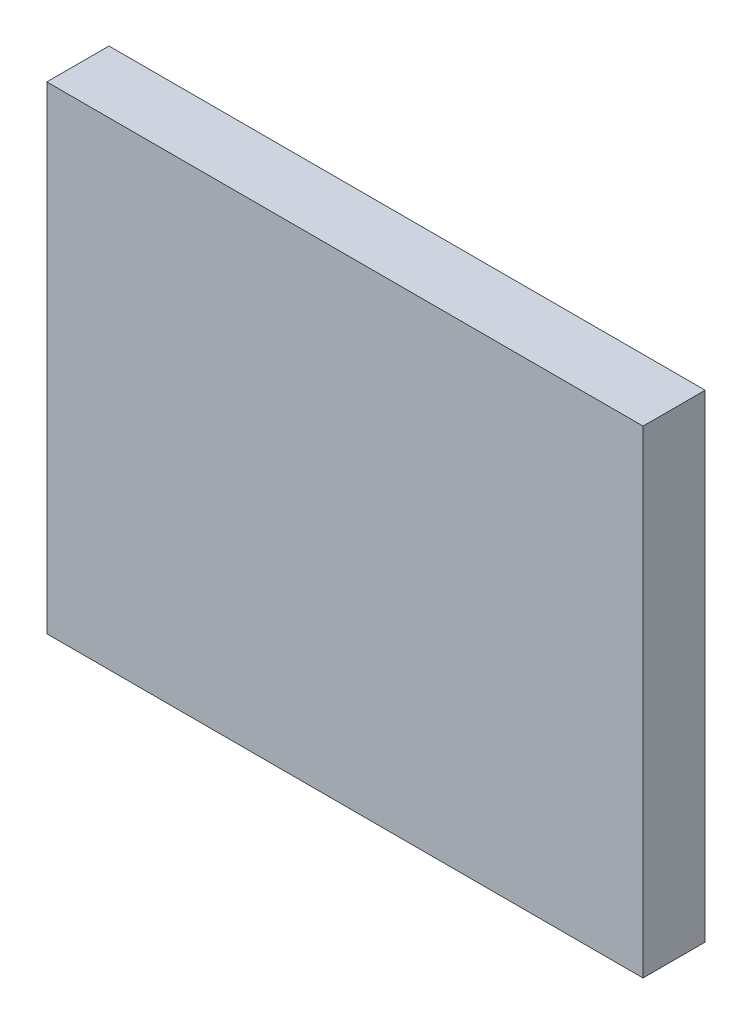
ISO-10303-21;
HEADER;
FILE_DESCRIPTION(('STEP AP214'),'2;1');
FILE_NAME('part.step','',(''),(''),'','','');
FILE_SCHEMA(('AUTOMOTIVE_DESIGN { 1 0 10303 214 1 1 1 1 }'));
ENDSEC;
DATA;
#1=APPLICATION_CONTEXT('core data for automotive mechanical design processes');
#2=APPLICATION_PROTOCOL_DEFINITION('international standard','automotive_design',2000,#1);
#3=PRODUCT_CONTEXT('',#1,'mechanical');
#4=PRODUCT('Part','Part','',(#3));
#5=PRODUCT_RELATED_PRODUCT_CATEGORY('part','',(#4));
#6=PRODUCT_DEFINITION_FORMATION('','',#4);
#7=PRODUCT_DEFINITION_CONTEXT('part definition',#1,'design');
#8=PRODUCT_DEFINITION('design','',#6,#7);
#9=PRODUCT_DEFINITION_SHAPE('','',#8);
#10=(LENGTH_UNIT() NAMED_UNIT(*) SI_UNIT(.MILLI.,.METRE.));
#11=(NAMED_UNIT(*) PLANE_ANGLE_UNIT() SI_UNIT($,.RADIAN.));
#12=(NAMED_UNIT(*) SI_UNIT($,.STERADIAN.) SOLID_ANGLE_UNIT());
#13=UNCERTAINTY_MEASURE_WITH_UNIT(LENGTH_MEASURE(1.E-05),#10,'distance_accuracy_value','');
#14=(GEOMETRIC_REPRESENTATION_CONTEXT(3) GLOBAL_UNCERTAINTY_ASSIGNED_CONTEXT((#13)) GLOBAL_UNIT_ASSIGNED_CONTEXT((#10,
#11,#12)) REPRESENTATION_CONTEXT('',''));
#15=CARTESIAN_POINT('',(0.,0.,0.));
#16=DIRECTION('',(0.,0.,1.));
#17=DIRECTION('',(1.,0.,0.));
#18=AXIS2_PLACEMENT_3D('',#15,#16,#17);
#19=CARTESIAN_POINT('',(49.4299950431041,38.446561782524,10.));
#20=DIRECTION('',(-1.,0.,0.));
#21=DIRECTION('',(0.,0.,1.));
#22=AXIS2_PLACEMENT_3D('',#19,#20,#21);
#23=PLANE('',#22);
#24=DIRECTION('',(0.,1.,0.));
#25=VECTOR('',#24,1.);
#26=CARTESIAN_POINT('',(49.4299950431041,38.446561782524,0.));
#27=LINE('',#26,#25);
#28=CARTESIAN_POINT('',(49.4299950431041,-38.446561782524,0.));
#29=VERTEX_POINT('',#28);
#30=CARTESIAN_POINT('',(49.4299950431041,38.446561782524,0.));
#31=VERTEX_POINT('',#30);
#32=EDGE_CURVE('E98',#29,#31,#27,.T.);
#33=ORIENTED_EDGE('',*,*,#32,.T.);
#34=DIRECTION('',(0.,0.,-1.));
#35=VECTOR('',#34,1.);
#36=CARTESIAN_POINT('',(49.4299950431041,38.446561782524,10.));
#37=LINE('',#36,#35);
#38=CARTESIAN_POINT('',(49.4299950431041,38.446561782524,10.));
#39=VERTEX_POINT('',#38);
#40=EDGE_CURVE('E11',#39,#31,#37,.T.);
#41=ORIENTED_EDGE('',*,*,#40,.F.);
#42=DIRECTION('',(0.,1.,0.));
#43=VECTOR('',#42,1.);
#44=CARTESIAN_POINT('',(49.4299950431041,38.446561782524,10.));
#45=LINE('',#44,#43);
#46=CARTESIAN_POINT('',(49.4299950431041,-38.446561782524,10.));
#47=VERTEX_POINT('',#46);
#48=EDGE_CURVE('E86',#47,#39,#45,.T.);
#49=ORIENTED_EDGE('',*,*,#48,.F.);
#50=DIRECTION('',(0.,0.,-1.));
#51=VECTOR('',#50,1.);
#52=CARTESIAN_POINT('',(49.4299950431041,-38.446561782524,10.));
#53=LINE('',#52,#51);
#54=EDGE_CURVE('E94',#47,#29,#53,.T.);
#55=ORIENTED_EDGE('',*,*,#54,.T.);
#56=EDGE_LOOP('',(#33,#41,#49,#55));
#57=FACE_BOUND('',#56,.T.);
#58=ADVANCED_FACE('F35',(#57),#23,.F.);
#59=CARTESIAN_POINT('',(-46.4882312596877,38.446561782524,10.));
#60=DIRECTION('',(0.,-1.,0.));
#61=DIRECTION('',(0.,0.,-1.));
#62=AXIS2_PLACEMENT_3D('',#59,#60,#61);
#63=PLANE('',#62);
#64=DIRECTION('',(-1.,0.,0.));
#65=VECTOR('',#64,1.);
#66=CARTESIAN_POINT('',(-46.4882312596877,38.446561782524,0.));
#67=LINE('',#66,#65);
#68=CARTESIAN_POINT('',(-46.4882312596877,38.446561782524,0.));
#69=VERTEX_POINT('',#68);
#70=EDGE_CURVE('E90',#31,#69,#67,.T.);
#71=ORIENTED_EDGE('',*,*,#70,.T.);
#72=DIRECTION('',(0.,0.,-1.));
#73=VECTOR('',#72,1.);
#74=CARTESIAN_POINT('',(-46.4882312596877,38.446561782524,10.));
#75=LINE('',#74,#73);
#76=CARTESIAN_POINT('',(-46.4882312596877,38.446561782524,10.));
#77=VERTEX_POINT('',#76);
#78=EDGE_CURVE('E43',#77,#69,#75,.T.);
#79=ORIENTED_EDGE('',*,*,#78,.F.);
#80=DIRECTION('',(-1.,0.,0.));
#81=VECTOR('',#80,1.);
#82=CARTESIAN_POINT('',(-46.4882312596877,38.446561782524,10.));
#83=LINE('',#82,#81);
#84=EDGE_CURVE('E81',#39,#77,#83,.T.);
#85=ORIENTED_EDGE('',*,*,#84,.F.);
#86=ORIENTED_EDGE('',*,*,#40,.T.);
#87=EDGE_LOOP('',(#71,#79,#85,#86));
#88=FACE_BOUND('',#87,.T.);
#89=ADVANCED_FACE('F89',(#88),#63,.F.);
#90=CARTESIAN_POINT('',(-46.4882312596877,38.446561782524,10.));
#91=DIRECTION('',(1.,0.,0.));
#92=DIRECTION('',(0.,0.,-1.));
#93=AXIS2_PLACEMENT_3D('',#90,#91,#92);
#94=PLANE('',#93);
#95=DIRECTION('',(0.,-1.,0.));
#96=VECTOR('',#95,1.);
#97=CARTESIAN_POINT('',(-46.4882312596877,38.446561782524,0.));
#98=LINE('',#97,#96);
#99=CARTESIAN_POINT('',(-46.4882312596877,-38.446561782524,0.));
#100=VERTEX_POINT('',#99);
#101=EDGE_CURVE('E68',#69,#100,#98,.T.);
#102=ORIENTED_EDGE('',*,*,#101,.T.);
#103=DIRECTION('',(0.,0.,-1.));
#104=VECTOR('',#103,1.);
#105=CARTESIAN_POINT('',(-46.4882312596877,-38.446561782524,10.));
#106=LINE('',#105,#104);
#107=CARTESIAN_POINT('',(-46.4882312596877,-38.446561782524,10.));
#108=VERTEX_POINT('',#107);
#109=EDGE_CURVE('E91',#108,#100,#106,.T.);
#110=ORIENTED_EDGE('',*,*,#109,.F.);
#111=DIRECTION('',(0.,-1.,0.));
#112=VECTOR('',#111,1.);
#113=CARTESIAN_POINT('',(-46.4882312596877,38.446561782524,10.));
#114=LINE('',#113,#112);
#115=EDGE_CURVE('E84',#77,#108,#114,.T.);
#116=ORIENTED_EDGE('',*,*,#115,.F.);
#117=ORIENTED_EDGE('',*,*,#78,.T.);
#118=EDGE_LOOP('',(#102,#110,#116,#117));
#119=FACE_BOUND('',#118,.T.);
#120=ADVANCED_FACE('F92',(#119),#94,.F.);
#121=CARTESIAN_POINT('',(-46.4882312596877,-38.446561782524,10.));
#122=DIRECTION('',(0.,1.,0.));
#123=DIRECTION('',(0.,0.,1.));
#124=AXIS2_PLACEMENT_3D('',#121,#122,#123);
#125=PLANE('',#124);
#126=DIRECTION('',(1.,0.,0.));
#127=VECTOR('',#126,1.);
#128=CARTESIAN_POINT('',(-46.4882312596877,-38.446561782524,0.));
#129=LINE('',#128,#127);
#130=EDGE_CURVE('E74',#100,#29,#129,.T.);
#131=ORIENTED_EDGE('',*,*,#130,.T.);
#132=ORIENTED_EDGE('',*,*,#54,.F.);
#133=DIRECTION('',(1.,0.,0.));
#134=VECTOR('',#133,1.);
#135=CARTESIAN_POINT('',(-46.4882312596877,-38.446561782524,10.));
#136=LINE('',#135,#134);
#137=EDGE_CURVE('E51',#108,#47,#136,.T.);
#138=ORIENTED_EDGE('',*,*,#137,.F.);
#139=ORIENTED_EDGE('',*,*,#109,.T.);
#140=EDGE_LOOP('',(#131,#132,#138,#139));
#141=FACE_BOUND('',#140,.T.);
#142=ADVANCED_FACE('F105',(#141),#125,.F.);
#143=CARTESIAN_POINT('',(0.,0.,10.));
#144=DIRECTION('',(0.,0.,1.));
#145=DIRECTION('',(1.,0.,0.));
#146=AXIS2_PLACEMENT_3D('',#143,#144,#145);
#147=PLANE('',#146);
#148=ORIENTED_EDGE('',*,*,#48,.T.);
#149=ORIENTED_EDGE('',*,*,#84,.T.);
#150=ORIENTED_EDGE('',*,*,#115,.T.);
#151=ORIENTED_EDGE('',*,*,#137,.T.);
#152=EDGE_LOOP('',(#148,#149,#150,#151));
#153=FACE_BOUND('',#152,.T.);
#154=ADVANCED_FACE('F82',(#153),#147,.T.);
#155=CARTESIAN_POINT('',(0.,0.,0.));
#156=DIRECTION('',(0.,0.,1.));
#157=DIRECTION('',(1.,0.,0.));
#158=AXIS2_PLACEMENT_3D('',#155,#156,#157);
#159=PLANE('',#158);
#160=ORIENTED_EDGE('',*,*,#32,.F.);
#161=ORIENTED_EDGE('',*,*,#130,.F.);
#162=ORIENTED_EDGE('',*,*,#101,.F.);
#163=ORIENTED_EDGE('',*,*,#70,.F.);
#164=EDGE_LOOP('',(#160,#161,#162,#163));
#165=FACE_BOUND('',#164,.T.);
#166=ADVANCED_FACE('F108',(#165),#159,.F.);
#167=CLOSED_SHELL('',(#58,#89,#120,#142,#154,#166));
#168=MANIFOLD_SOLID_BREP('B2',#167);
#169=ADVANCED_BREP_SHAPE_REPRESENTATION('',(#18,#168),#14);
#170=SHAPE_DEFINITION_REPRESENTATION(#9,#169);
ENDSEC;
END-ISO-10303-21;
